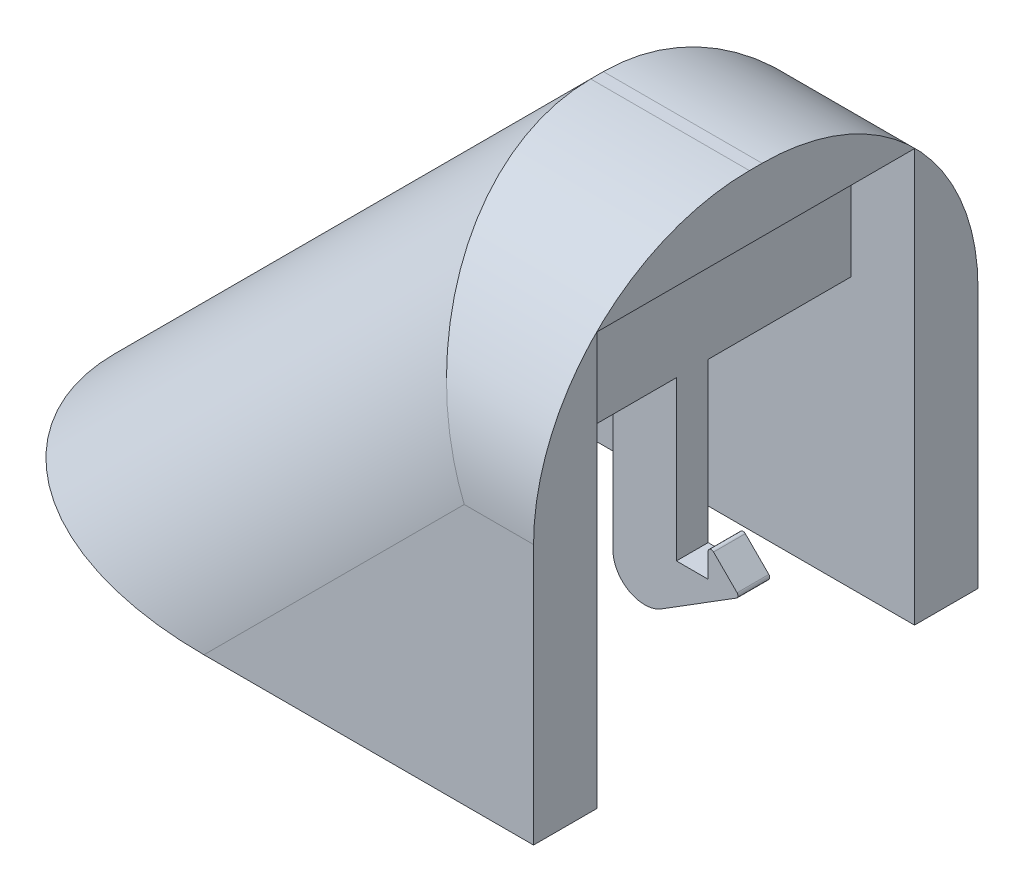
ISO-10303-21;
HEADER;
FILE_DESCRIPTION(('STEP AP214'),'2;1');
FILE_NAME('part.step','',(''),(''),'','','');
FILE_SCHEMA(('AUTOMOTIVE_DESIGN { 1 0 10303 214 1 1 1 1 }'));
ENDSEC;
DATA;
#1=APPLICATION_CONTEXT('core data for automotive mechanical design processes');
#2=APPLICATION_PROTOCOL_DEFINITION('international standard','automotive_design',2000,#1);
#3=PRODUCT_CONTEXT('',#1,'mechanical');
#4=PRODUCT('Part','Part','',(#3));
#5=PRODUCT_RELATED_PRODUCT_CATEGORY('part','',(#4));
#6=PRODUCT_DEFINITION_FORMATION('','',#4);
#7=PRODUCT_DEFINITION_CONTEXT('part definition',#1,'design');
#8=PRODUCT_DEFINITION('design','',#6,#7);
#9=PRODUCT_DEFINITION_SHAPE('','',#8);
#10=(LENGTH_UNIT() NAMED_UNIT(*) SI_UNIT(.MILLI.,.METRE.));
#11=(NAMED_UNIT(*) PLANE_ANGLE_UNIT() SI_UNIT($,.RADIAN.));
#12=(NAMED_UNIT(*) SI_UNIT($,.STERADIAN.) SOLID_ANGLE_UNIT());
#13=UNCERTAINTY_MEASURE_WITH_UNIT(LENGTH_MEASURE(1.E-05),#10,'distance_accuracy_value','');
#14=(GEOMETRIC_REPRESENTATION_CONTEXT(3) GLOBAL_UNCERTAINTY_ASSIGNED_CONTEXT((#13)) GLOBAL_UNIT_ASSIGNED_CONTEXT((#10,
#11,#12)) REPRESENTATION_CONTEXT('',''));
#15=CARTESIAN_POINT('',(0.,0.,0.));
#16=DIRECTION('',(0.,0.,1.));
#17=DIRECTION('',(1.,0.,0.));
#18=AXIS2_PLACEMENT_3D('',#15,#16,#17);
#19=CARTESIAN_POINT('',(-2.,8.5014980509861,7.002));
#20=DIRECTION('',(0.,1.,0.));
#21=DIRECTION('',(0.,0.,1.));
#22=AXIS2_PLACEMENT_3D('',#19,#20,#21);
#23=PLANE('',#22);
#24=DIRECTION('',(-1.,0.,0.));
#25=VECTOR('',#24,1.);
#26=CARTESIAN_POINT('',(-2.,8.5014980509861,0.5));
#27=LINE('',#26,#25);
#28=CARTESIAN_POINT('',(-2.,8.5014980509861,0.5));
#29=VERTEX_POINT('',#28);
#30=CARTESIAN_POINT('',(-4.,8.5014980509861,0.5));
#31=VERTEX_POINT('',#30);
#32=EDGE_CURVE('E261',#29,#31,#27,.T.);
#33=ORIENTED_EDGE('',*,*,#32,.F.);
#34=DIRECTION('',(0.,0.,-1.));
#35=VECTOR('',#34,1.);
#36=CARTESIAN_POINT('',(-2.,8.5014980509861,7.002));
#37=LINE('',#36,#35);
#38=CARTESIAN_POINT('',(-2.,8.5014980509861,5.));
#39=VERTEX_POINT('',#38);
#40=EDGE_CURVE('E285',#39,#29,#37,.T.);
#41=ORIENTED_EDGE('',*,*,#40,.F.);
#42=DIRECTION('',(1.,0.,0.));
#43=VECTOR('',#42,1.);
#44=CARTESIAN_POINT('',(-2.,8.5014980509861,5.));
#45=LINE('',#44,#43);
#46=CARTESIAN_POINT('',(-4.,8.5014980509861,5.));
#47=VERTEX_POINT('',#46);
#48=EDGE_CURVE('E293',#47,#39,#45,.T.);
#49=ORIENTED_EDGE('',*,*,#48,.F.);
#50=DIRECTION('',(0.,0.,-1.));
#51=VECTOR('',#50,1.);
#52=CARTESIAN_POINT('',(-4.,8.5014980509861,7.002));
#53=LINE('',#52,#51);
#54=EDGE_CURVE('E289',#47,#31,#53,.T.);
#55=ORIENTED_EDGE('',*,*,#54,.T.);
#56=EDGE_LOOP('',(#33,#41,#49,#55));
#57=FACE_BOUND('',#56,.T.);
#58=ADVANCED_FACE('F38',(#57),#23,.F.);
#59=DIRECTION('',(1.,0.,0.));
#60=VECTOR('',#59,1.);
#61=CARTESIAN_POINT('',(-2.,8.5014980509861,-0.5));
#62=LINE('',#61,#60);
#63=CARTESIAN_POINT('',(-4.,8.5014980509861,-0.499999999999999));
#64=VERTEX_POINT('',#63);
#65=CARTESIAN_POINT('',(-2.,8.5014980509861,-0.499999999999999));
#66=VERTEX_POINT('',#65);
#67=EDGE_CURVE('E264',#64,#66,#62,.T.);
#68=ORIENTED_EDGE('',*,*,#67,.F.);
#69=CARTESIAN_POINT('',(-4.,8.5014980509861,-5.));
#70=VERTEX_POINT('',#69);
#71=EDGE_CURVE('E288',#64,#70,#53,.T.);
#72=ORIENTED_EDGE('',*,*,#71,.T.);
#73=DIRECTION('',(1.,0.,0.));
#74=VECTOR('',#73,1.);
#75=CARTESIAN_POINT('',(-2.,8.5014980509861,-5.));
#76=LINE('',#75,#74);
#77=CARTESIAN_POINT('',(-2.,8.5014980509861,-5.));
#78=VERTEX_POINT('',#77);
#79=EDGE_CURVE('E281',#70,#78,#76,.T.);
#80=ORIENTED_EDGE('',*,*,#79,.T.);
#81=EDGE_CURVE('E280',#66,#78,#37,.T.);
#82=ORIENTED_EDGE('',*,*,#81,.F.);
#83=EDGE_LOOP('',(#68,#72,#80,#82));
#84=FACE_BOUND('',#83,.T.);
#85=ADVANCED_FACE('F469',(#84),#23,.F.);
#86=CARTESIAN_POINT('',(0.,13.,7.));
#87=DIRECTION('',(0.,-1.,0.));
#88=DIRECTION('',(0.,0.,-1.));
#89=AXIS2_PLACEMENT_3D('',#86,#87,#88);
#90=PLANE('',#89);
#91=DIRECTION('',(-1.,0.,0.));
#92=VECTOR('',#91,1.);
#93=CARTESIAN_POINT('',(0.,13.,5.));
#94=LINE('',#93,#92);
#95=CARTESIAN_POINT('',(0.,13.,5.));
#96=VERTEX_POINT('',#95);
#97=CARTESIAN_POINT('',(-2.,13.,5.));
#98=VERTEX_POINT('',#97);
#99=EDGE_CURVE('E318',#96,#98,#94,.T.);
#100=ORIENTED_EDGE('',*,*,#99,.T.);
#101=DIRECTION('',(0.,0.,1.));
#102=VECTOR('',#101,1.);
#103=CARTESIAN_POINT('',(-2.,13.,7.002));
#104=LINE('',#103,#102);
#105=CARTESIAN_POINT('',(-2.,13.,-5.));
#106=VERTEX_POINT('',#105);
#107=EDGE_CURVE('E299',#106,#98,#104,.T.);
#108=ORIENTED_EDGE('',*,*,#107,.F.);
#109=DIRECTION('',(-1.,0.,0.));
#110=VECTOR('',#109,1.);
#111=CARTESIAN_POINT('',(0.,13.,-5.));
#112=LINE('',#111,#110);
#113=CARTESIAN_POINT('',(0.,13.,-5.));
#114=VERTEX_POINT('',#113);
#115=EDGE_CURVE('E315',#114,#106,#112,.T.);
#116=ORIENTED_EDGE('',*,*,#115,.F.);
#117=DIRECTION('',(0.,0.,-1.));
#118=VECTOR('',#117,1.);
#119=CARTESIAN_POINT('',(0.,13.,7.));
#120=LINE('',#119,#118);
#121=EDGE_CURVE('E321',#96,#114,#120,.T.);
#122=ORIENTED_EDGE('',*,*,#121,.F.);
#123=EDGE_LOOP('',(#100,#108,#116,#122));
#124=FACE_BOUND('',#123,.T.);
#125=ADVANCED_FACE('F503',(#124),#90,.T.);
#126=CARTESIAN_POINT('',(-4.,13.,-5.));
#127=VERTEX_POINT('',#126);
#128=CARTESIAN_POINT('',(-4.17157287525381,13.,-5.));
#129=VERTEX_POINT('',#128);
#130=EDGE_CURVE('E324',#127,#129,#112,.T.);
#131=ORIENTED_EDGE('',*,*,#130,.F.);
#132=DIRECTION('',(0.,0.,-1.));
#133=VECTOR('',#132,1.);
#134=CARTESIAN_POINT('',(-4.,13.,7.002));
#135=LINE('',#134,#133);
#136=CARTESIAN_POINT('',(-4.,13.,5.));
#137=VERTEX_POINT('',#136);
#138=EDGE_CURVE('E292',#137,#127,#135,.T.);
#139=ORIENTED_EDGE('',*,*,#138,.F.);
#140=CARTESIAN_POINT('',(-4.17157287525381,13.,5.));
#141=VERTEX_POINT('',#140);
#142=EDGE_CURVE('E327',#137,#141,#94,.T.);
#143=ORIENTED_EDGE('',*,*,#142,.T.);
#144=DIRECTION('',(0.,0.,-1.));
#145=VECTOR('',#144,1.);
#146=CARTESIAN_POINT('',(-4.17157287525381,13.,7.));
#147=LINE('',#146,#145);
#148=EDGE_CURVE('E309',#141,#129,#147,.T.);
#149=ORIENTED_EDGE('',*,*,#148,.T.);
#150=EDGE_LOOP('',(#131,#139,#143,#149));
#151=FACE_BOUND('',#150,.T.);
#152=ADVANCED_FACE('F456',(#151),#90,.T.);
#153=CARTESIAN_POINT('',(0.,0.,5.));
#154=DIRECTION('',(0.,0.,1.));
#155=DIRECTION('',(1.,0.,0.));
#156=AXIS2_PLACEMENT_3D('',#153,#154,#155);
#157=PLANE('',#156);
#158=DIRECTION('',(0.,1.,0.));
#159=VECTOR('',#158,1.);
#160=CARTESIAN_POINT('',(-2.,18.5014980509861,5.));
#161=LINE('',#160,#159);
#162=EDGE_CURVE('E301',#39,#98,#161,.T.);
#163=ORIENTED_EDGE('',*,*,#162,.T.);
#164=ORIENTED_EDGE('',*,*,#99,.F.);
#165=DIRECTION('',(0.,1.,0.));
#166=VECTOR('',#165,1.);
#167=CARTESIAN_POINT('',(0.,0.,5.));
#168=LINE('',#167,#166);
#169=CARTESIAN_POINT('',(0.,0.,5.));
#170=VERTEX_POINT('',#169);
#171=EDGE_CURVE('E314',#170,#96,#168,.T.);
#172=ORIENTED_EDGE('',*,*,#171,.F.);
#173=DIRECTION('',(1.,0.,0.));
#174=VECTOR('',#173,1.);
#175=CARTESIAN_POINT('',(-20.,0.,5.));
#176=LINE('',#175,#174);
#177=CARTESIAN_POINT('',(-15.1715728752538,0.,5.));
#178=VERTEX_POINT('',#177);
#179=EDGE_CURVE('E258',#178,#170,#176,.T.);
#180=ORIENTED_EDGE('',*,*,#179,.F.);
#181=DIRECTION('',(0.,1.,0.));
#182=VECTOR('',#181,1.);
#183=CARTESIAN_POINT('',(-15.1715728752538,-3.,5.));
#184=LINE('',#183,#182);
#185=CARTESIAN_POINT('',(-15.1715728752538,2.,5.));
#186=VERTEX_POINT('',#185);
#187=EDGE_CURVE('E249',#178,#186,#184,.T.);
#188=ORIENTED_EDGE('',*,*,#187,.T.);
#189=DIRECTION('',(-0.707106781186548,-0.707106781186548,0.));
#190=VECTOR('',#189,1.);
#191=CARTESIAN_POINT('',(-3.58578643762691,13.5857864376269,5.));
#192=LINE('',#191,#190);
#193=EDGE_CURVE('E310',#141,#186,#192,.T.);
#194=ORIENTED_EDGE('',*,*,#193,.F.);
#195=ORIENTED_EDGE('',*,*,#142,.F.);
#196=DIRECTION('',(0.,-1.,0.));
#197=VECTOR('',#196,1.);
#198=CARTESIAN_POINT('',(-4.,18.5014980509861,5.));
#199=LINE('',#198,#197);
#200=EDGE_CURVE('E297',#137,#47,#199,.T.);
#201=ORIENTED_EDGE('',*,*,#200,.T.);
#202=ORIENTED_EDGE('',*,*,#48,.T.);
#203=EDGE_LOOP('',(#163,#164,#172,#180,#188,#194,#195,#201,#202));
#204=FACE_BOUND('',#203,.T.);
#205=ADVANCED_FACE('F441',(#204),#157,.F.);
#206=CARTESIAN_POINT('',(0.,0.,-5.));
#207=DIRECTION('',(0.,0.,1.));
#208=DIRECTION('',(1.,0.,0.));
#209=AXIS2_PLACEMENT_3D('',#206,#207,#208);
#210=PLANE('',#209);
#211=ORIENTED_EDGE('',*,*,#115,.T.);
#212=DIRECTION('',(0.,1.,0.));
#213=VECTOR('',#212,1.);
#214=CARTESIAN_POINT('',(-2.,18.5014980509861,-5.));
#215=LINE('',#214,#213);
#216=EDGE_CURVE('E276',#78,#106,#215,.T.);
#217=ORIENTED_EDGE('',*,*,#216,.F.);
#218=ORIENTED_EDGE('',*,*,#79,.F.);
#219=DIRECTION('',(0.,-1.,0.));
#220=VECTOR('',#219,1.);
#221=CARTESIAN_POINT('',(-4.,18.5014980509861,-5.));
#222=LINE('',#221,#220);
#223=EDGE_CURVE('E277',#127,#70,#222,.T.);
#224=ORIENTED_EDGE('',*,*,#223,.F.);
#225=ORIENTED_EDGE('',*,*,#130,.T.);
#226=DIRECTION('',(-0.707106781186548,-0.707106781186548,0.));
#227=VECTOR('',#226,1.);
#228=CARTESIAN_POINT('',(-3.58578643762691,13.5857864376269,-5.));
#229=LINE('',#228,#227);
#230=CARTESIAN_POINT('',(-15.1715728752538,2.,-5.));
#231=VERTEX_POINT('',#230);
#232=EDGE_CURVE('E311',#129,#231,#229,.T.);
#233=ORIENTED_EDGE('',*,*,#232,.T.);
#234=DIRECTION('',(0.,1.,0.));
#235=VECTOR('',#234,1.);
#236=CARTESIAN_POINT('',(-15.1715728752538,-3.,-5.));
#237=LINE('',#236,#235);
#238=CARTESIAN_POINT('',(-15.1715728752538,0.,-5.));
#239=VERTEX_POINT('',#238);
#240=EDGE_CURVE('E243',#239,#231,#237,.T.);
#241=ORIENTED_EDGE('',*,*,#240,.F.);
#242=DIRECTION('',(-1.,0.,0.));
#243=VECTOR('',#242,1.);
#244=CARTESIAN_POINT('',(-20.,0.,-5.));
#245=LINE('',#244,#243);
#246=CARTESIAN_POINT('',(0.,0.,-5.));
#247=VERTEX_POINT('',#246);
#248=EDGE_CURVE('E255',#247,#239,#245,.T.);
#249=ORIENTED_EDGE('',*,*,#248,.F.);
#250=DIRECTION('',(0.,1.,0.));
#251=VECTOR('',#250,1.);
#252=CARTESIAN_POINT('',(0.,0.,-5.));
#253=LINE('',#252,#251);
#254=EDGE_CURVE('E296',#247,#114,#253,.T.);
#255=ORIENTED_EDGE('',*,*,#254,.T.);
#256=EDGE_LOOP('',(#211,#217,#218,#224,#225,#233,#241,#249,#255));
#257=FACE_BOUND('',#256,.T.);
#258=ADVANCED_FACE('F465',(#257),#210,.T.);
#259=CARTESIAN_POINT('',(0.,0.,7.));
#260=DIRECTION('',(-1.,0.,0.));
#261=DIRECTION('',(0.,0.,1.));
#262=AXIS2_PLACEMENT_3D('',#259,#260,#261);
#263=PLANE('',#262);
#264=DIRECTION('',(0.,1.,0.));
#265=VECTOR('',#264,1.);
#266=CARTESIAN_POINT('',(0.,0.,-7.));
#267=LINE('',#266,#265);
#268=CARTESIAN_POINT('',(0.,0.,-7.));
#269=VERTEX_POINT('',#268);
#270=CARTESIAN_POINT('',(0.,8.2,-7.));
#271=VERTEX_POINT('',#270);
#272=EDGE_CURVE('E337',#269,#271,#267,.T.);
#273=ORIENTED_EDGE('',*,*,#272,.T.);
#274=CARTESIAN_POINT('',(0.,8.2,-0.199999999999999));
#275=DIRECTION('',(-1.,0.,0.));
#276=DIRECTION('',(0.,0.,1.));
#277=AXIS2_PLACEMENT_3D('',#274,#275,#276);
#278=CIRCLE('',#277,6.8);
#279=CARTESIAN_POINT('',(0.,15.,-0.199999999999997));
#280=VERTEX_POINT('',#279);
#281=EDGE_CURVE('E400',#271,#280,#278,.F.);
#282=ORIENTED_EDGE('',*,*,#281,.T.);
#283=DIRECTION('',(0.,0.,-1.));
#284=VECTOR('',#283,1.);
#285=CARTESIAN_POINT('',(0.,15.,7.));
#286=LINE('',#285,#284);
#287=CARTESIAN_POINT('',(0.,15.,0.200000000000001));
#288=VERTEX_POINT('',#287);
#289=EDGE_CURVE('E348',#288,#280,#286,.T.);
#290=ORIENTED_EDGE('',*,*,#289,.F.);
#291=CARTESIAN_POINT('',(0.,8.2,0.199999999999999));
#292=DIRECTION('',(-1.,0.,0.));
#293=DIRECTION('',(0.,0.,1.));
#294=AXIS2_PLACEMENT_3D('',#291,#292,#293);
#295=CIRCLE('',#294,6.8);
#296=CARTESIAN_POINT('',(0.,8.2,7.));
#297=VERTEX_POINT('',#296);
#298=EDGE_CURVE('E61',#288,#297,#295,.F.);
#299=ORIENTED_EDGE('',*,*,#298,.T.);
#300=DIRECTION('',(0.,1.,0.));
#301=VECTOR('',#300,1.);
#302=CARTESIAN_POINT('',(0.,0.,7.));
#303=LINE('',#302,#301);
#304=CARTESIAN_POINT('',(0.,0.,7.));
#305=VERTEX_POINT('',#304);
#306=EDGE_CURVE('E336',#305,#297,#303,.T.);
#307=ORIENTED_EDGE('',*,*,#306,.F.);
#308=DIRECTION('',(0.,0.,-1.));
#309=VECTOR('',#308,1.);
#310=CARTESIAN_POINT('',(0.,0.,7.));
#311=LINE('',#310,#309);
#312=EDGE_CURVE('E352',#305,#170,#311,.T.);
#313=ORIENTED_EDGE('',*,*,#312,.T.);
#314=ORIENTED_EDGE('',*,*,#171,.T.);
#315=ORIENTED_EDGE('',*,*,#121,.T.);
#316=ORIENTED_EDGE('',*,*,#254,.F.);
#317=EDGE_CURVE('E351',#247,#269,#311,.T.);
#318=ORIENTED_EDGE('',*,*,#317,.T.);
#319=EDGE_LOOP('',(#273,#282,#290,#299,#307,#313,#314,#315,#316,#318));
#320=FACE_BOUND('',#319,.T.);
#321=ADVANCED_FACE('F423',(#320),#263,.F.);
#322=CARTESIAN_POINT('',(-20.,0.,7.));
#323=DIRECTION('',(0.,1.,0.));
#324=DIRECTION('',(0.,0.,1.));
#325=AXIS2_PLACEMENT_3D('',#322,#323,#324);
#326=PLANE('',#325);
#327=DIRECTION('',(0.,0.,-1.));
#328=VECTOR('',#327,1.);
#329=CARTESIAN_POINT('',(-20.,0.,7.));
#330=LINE('',#329,#328);
#331=CARTESIAN_POINT('',(-20.,0.,0.200000000000001));
#332=VERTEX_POINT('',#331);
#333=CARTESIAN_POINT('',(-20.,0.,-0.199999999999997));
#334=VERTEX_POINT('',#333);
#335=EDGE_CURVE('E339',#332,#334,#330,.T.);
#336=ORIENTED_EDGE('',*,*,#335,.T.);
#337=CARTESIAN_POINT('',(-10.383347775863,0.,-0.199999999999999));
#338=DIRECTION('',(0.,1.,0.));
#339=DIRECTION('',(-1.,0.,0.));
#340=AXIS2_PLACEMENT_3D('',#337,#338,#339);
#341=ELLIPSE('',#340,9.61665222413705,6.8);
#342=CARTESIAN_POINT('',(-10.383347775863,0.,-7.));
#343=VERTEX_POINT('',#342);
#344=EDGE_CURVE('E389',#334,#343,#341,.F.);
#345=ORIENTED_EDGE('',*,*,#344,.T.);
#346=DIRECTION('',(1.,0.,0.));
#347=VECTOR('',#346,1.);
#348=CARTESIAN_POINT('',(-20.,0.,-7.));
#349=LINE('',#348,#347);
#350=EDGE_CURVE('E331',#343,#269,#349,.T.);
#351=ORIENTED_EDGE('',*,*,#350,.T.);
#352=ORIENTED_EDGE('',*,*,#317,.F.);
#353=ORIENTED_EDGE('',*,*,#248,.T.);
#354=DIRECTION('',(0.,0.,1.));
#355=VECTOR('',#354,1.);
#356=CARTESIAN_POINT('',(-15.1715728752538,0.,7.));
#357=LINE('',#356,#355);
#358=EDGE_CURVE('E251',#239,#178,#357,.T.);
#359=ORIENTED_EDGE('',*,*,#358,.T.);
#360=ORIENTED_EDGE('',*,*,#179,.T.);
#361=ORIENTED_EDGE('',*,*,#312,.F.);
#362=DIRECTION('',(1.,0.,0.));
#363=VECTOR('',#362,1.);
#364=CARTESIAN_POINT('',(-20.,0.,7.));
#365=LINE('',#364,#363);
#366=CARTESIAN_POINT('',(-10.383347775863,0.,7.));
#367=VERTEX_POINT('',#366);
#368=EDGE_CURVE('E334',#367,#305,#365,.T.);
#369=ORIENTED_EDGE('',*,*,#368,.F.);
#370=CARTESIAN_POINT('',(-10.383347775863,0.,0.199999999999999));
#371=DIRECTION('',(0.,1.,0.));
#372=DIRECTION('',(1.,0.,0.));
#373=AXIS2_PLACEMENT_3D('',#370,#371,#372);
#374=ELLIPSE('',#373,9.61665222413705,6.8);
#375=EDGE_CURVE('E387',#367,#332,#374,.F.);
#376=ORIENTED_EDGE('',*,*,#375,.T.);
#377=EDGE_LOOP('',(#336,#345,#351,#352,#353,#359,#360,#361,#369,#376));
#378=FACE_BOUND('',#377,.T.);
#379=ADVANCED_FACE('F434',(#378),#326,.F.);
#380=CARTESIAN_POINT('',(0.,15.,7.));
#381=DIRECTION('',(0.,-1.,0.));
#382=DIRECTION('',(0.,0.,-1.));
#383=AXIS2_PLACEMENT_3D('',#380,#381,#382);
#384=PLANE('',#383);
#385=ORIENTED_EDGE('',*,*,#289,.T.);
#386=DIRECTION('',(-1.,0.,0.));
#387=VECTOR('',#386,1.);
#388=CARTESIAN_POINT('',(0.,15.,-0.199999999999999));
#389=LINE('',#388,#387);
#390=CARTESIAN_POINT('',(-5.,15.,-0.199999999999997));
#391=VERTEX_POINT('',#390);
#392=EDGE_CURVE('E397',#280,#391,#389,.T.);
#393=ORIENTED_EDGE('',*,*,#392,.T.);
#394=DIRECTION('',(0.,0.,-1.));
#395=VECTOR('',#394,1.);
#396=CARTESIAN_POINT('',(-5.,15.,7.));
#397=LINE('',#396,#395);
#398=CARTESIAN_POINT('',(-5.,15.,0.200000000000001));
#399=VERTEX_POINT('',#398);
#400=EDGE_CURVE('E345',#399,#391,#397,.T.);
#401=ORIENTED_EDGE('',*,*,#400,.F.);
#402=DIRECTION('',(-1.,0.,0.));
#403=VECTOR('',#402,1.);
#404=CARTESIAN_POINT('',(0.,15.,0.199999999999999));
#405=LINE('',#404,#403);
#406=EDGE_CURVE('E395',#399,#288,#405,.F.);
#407=ORIENTED_EDGE('',*,*,#406,.T.);
#408=EDGE_LOOP('',(#385,#393,#401,#407));
#409=FACE_BOUND('',#408,.T.);
#410=ADVANCED_FACE('F421',(#409),#384,.F.);
#411=CARTESIAN_POINT('',(-5.,15.,7.));
#412=DIRECTION('',(0.707106781186548,-0.707106781186548,0.));
#413=DIRECTION('',(0.707106781186548,0.707106781186548,0.));
#414=AXIS2_PLACEMENT_3D('',#411,#412,#413);
#415=PLANE('',#414);
#416=ORIENTED_EDGE('',*,*,#400,.T.);
#417=DIRECTION('',(-0.707106781186548,-0.707106781186548,0.));
#418=VECTOR('',#417,1.);
#419=CARTESIAN_POINT('',(-5.,15.,-0.199999999999999));
#420=LINE('',#419,#418);
#421=EDGE_CURVE('E384',#391,#334,#420,.T.);
#422=ORIENTED_EDGE('',*,*,#421,.T.);
#423=ORIENTED_EDGE('',*,*,#335,.F.);
#424=DIRECTION('',(-0.707106781186548,-0.707106781186548,0.));
#425=VECTOR('',#424,1.);
#426=CARTESIAN_POINT('',(-5.,15.,0.199999999999999));
#427=LINE('',#426,#425);
#428=EDGE_CURVE('E382',#332,#399,#427,.F.);
#429=ORIENTED_EDGE('',*,*,#428,.T.);
#430=EDGE_LOOP('',(#416,#422,#423,#429));
#431=FACE_BOUND('',#430,.T.);
#432=ADVANCED_FACE('F431',(#431),#415,.F.);
#433=CARTESIAN_POINT('',(0.,0.,7.));
#434=DIRECTION('',(0.,0.,1.));
#435=DIRECTION('',(1.,0.,0.));
#436=AXIS2_PLACEMENT_3D('',#433,#434,#435);
#437=PLANE('',#436);
#438=DIRECTION('',(-1.,0.,0.));
#439=VECTOR('',#438,1.);
#440=CARTESIAN_POINT('',(-5.,8.2,7.));
#441=LINE('',#440,#439);
#442=CARTESIAN_POINT('',(-2.18334777586295,8.2,7.));
#443=VERTEX_POINT('',#442);
#444=EDGE_CURVE('E47',#297,#443,#441,.T.);
#445=ORIENTED_EDGE('',*,*,#444,.T.);
#446=DIRECTION('',(-0.707106781186548,-0.707106781186548,0.));
#447=VECTOR('',#446,1.);
#448=CARTESIAN_POINT('',(-15.1916738879315,-4.80832611206852,7.));
#449=LINE('',#448,#447);
#450=EDGE_CURVE('E11',#443,#367,#449,.T.);
#451=ORIENTED_EDGE('',*,*,#450,.T.);
#452=ORIENTED_EDGE('',*,*,#368,.T.);
#453=ORIENTED_EDGE('',*,*,#306,.T.);
#454=EDGE_LOOP('',(#445,#451,#452,#453));
#455=FACE_BOUND('',#454,.T.);
#456=ADVANCED_FACE('F438',(#455),#437,.T.);
#457=CARTESIAN_POINT('',(0.,0.,-7.));
#458=DIRECTION('',(0.,0.,1.));
#459=DIRECTION('',(1.,0.,0.));
#460=AXIS2_PLACEMENT_3D('',#457,#458,#459);
#461=PLANE('',#460);
#462=ORIENTED_EDGE('',*,*,#350,.F.);
#463=DIRECTION('',(-0.707106781186548,-0.707106781186548,0.));
#464=VECTOR('',#463,1.);
#465=CARTESIAN_POINT('',(-5.19167388793148,5.19167388793148,-7.));
#466=LINE('',#465,#464);
#467=CARTESIAN_POINT('',(-2.18334777586295,8.2,-7.));
#468=VERTEX_POINT('',#467);
#469=EDGE_CURVE('E393',#343,#468,#466,.F.);
#470=ORIENTED_EDGE('',*,*,#469,.T.);
#471=DIRECTION('',(-1.,0.,0.));
#472=VECTOR('',#471,1.);
#473=CARTESIAN_POINT('',(0.,8.2,-7.));
#474=LINE('',#473,#472);
#475=EDGE_CURVE('E391',#468,#271,#474,.F.);
#476=ORIENTED_EDGE('',*,*,#475,.T.);
#477=ORIENTED_EDGE('',*,*,#272,.F.);
#478=EDGE_LOOP('',(#462,#470,#476,#477));
#479=FACE_BOUND('',#478,.T.);
#480=ADVANCED_FACE('F508',(#479),#461,.F.);
#481=CARTESIAN_POINT('',(-3.58578643762691,13.5857864376269,7.));
#482=DIRECTION('',(0.707106781186548,-0.707106781186548,0.));
#483=DIRECTION('',(0.707106781186548,0.707106781186548,0.));
#484=AXIS2_PLACEMENT_3D('',#481,#482,#483);
#485=PLANE('',#484);
#486=ORIENTED_EDGE('',*,*,#232,.F.);
#487=ORIENTED_EDGE('',*,*,#148,.F.);
#488=ORIENTED_EDGE('',*,*,#193,.T.);
#489=DIRECTION('',(0.,0.,-1.));
#490=VECTOR('',#489,1.);
#491=CARTESIAN_POINT('',(-15.1715728752538,2.,7.));
#492=LINE('',#491,#490);
#493=EDGE_CURVE('E306',#186,#231,#492,.T.);
#494=ORIENTED_EDGE('',*,*,#493,.T.);
#495=EDGE_LOOP('',(#486,#487,#488,#494));
#496=FACE_BOUND('',#495,.T.);
#497=ADVANCED_FACE('F451',(#496),#485,.T.);
#498=CARTESIAN_POINT('',(-2.,18.5014980509861,7.002));
#499=DIRECTION('',(-1.,0.,0.));
#500=DIRECTION('',(0.,-1.,0.));
#501=AXIS2_PLACEMENT_3D('',#498,#499,#500);
#502=PLANE('',#501);
#503=ORIENTED_EDGE('',*,*,#162,.F.);
#504=ORIENTED_EDGE('',*,*,#40,.T.);
#505=DIRECTION('',(0.,1.,0.));
#506=VECTOR('',#505,1.);
#507=CARTESIAN_POINT('',(-2.,3.5014980509861,0.5));
#508=LINE('',#507,#506);
#509=CARTESIAN_POINT('',(-2.,3.5014980509861,0.500000000000001));
#510=VERTEX_POINT('',#509);
#511=EDGE_CURVE('E273',#510,#29,#508,.T.);
#512=ORIENTED_EDGE('',*,*,#511,.F.);
#513=DIRECTION('',(0.,0.,1.));
#514=VECTOR('',#513,1.);
#515=CARTESIAN_POINT('',(-2.,3.5014980509861,0.5));
#516=LINE('',#515,#514);
#517=CARTESIAN_POINT('',(-2.,3.5014980509861,-0.5));
#518=VERTEX_POINT('',#517);
#519=EDGE_CURVE('E262',#518,#510,#516,.T.);
#520=ORIENTED_EDGE('',*,*,#519,.F.);
#521=DIRECTION('',(0.,1.,0.));
#522=VECTOR('',#521,1.);
#523=CARTESIAN_POINT('',(-2.,3.5014980509861,-0.5));
#524=LINE('',#523,#522);
#525=EDGE_CURVE('E239',#518,#66,#524,.T.);
#526=ORIENTED_EDGE('',*,*,#525,.T.);
#527=ORIENTED_EDGE('',*,*,#81,.T.);
#528=ORIENTED_EDGE('',*,*,#216,.T.);
#529=ORIENTED_EDGE('',*,*,#107,.T.);
#530=EDGE_LOOP('',(#503,#504,#512,#520,#526,#527,#528,#529));
#531=FACE_BOUND('',#530,.T.);
#532=ADVANCED_FACE('F498',(#531),#502,.F.);
#533=CARTESIAN_POINT('',(-4.,18.5014980509861,7.002));
#534=DIRECTION('',(1.,0.,0.));
#535=DIRECTION('',(0.,1.,0.));
#536=AXIS2_PLACEMENT_3D('',#533,#534,#535);
#537=PLANE('',#536);
#538=DIRECTION('',(0.,1.,0.));
#539=VECTOR('',#538,1.);
#540=CARTESIAN_POINT('',(-4.,3.5014980509861,-0.499999999999999));
#541=LINE('',#540,#539);
#542=CARTESIAN_POINT('',(-4.,2.80574569249318,-0.499999999999999));
#543=VERTEX_POINT('',#542);
#544=EDGE_CURVE('E269',#543,#64,#541,.T.);
#545=ORIENTED_EDGE('',*,*,#544,.F.);
#546=DIRECTION('',(0.,0.,-1.));
#547=VECTOR('',#546,1.);
#548=CARTESIAN_POINT('',(-4.,2.80574569249318,7.002));
#549=LINE('',#548,#547);
#550=CARTESIAN_POINT('',(-4.,2.80574569249318,0.5));
#551=VERTEX_POINT('',#550);
#552=EDGE_CURVE('E378',#543,#551,#549,.F.);
#553=ORIENTED_EDGE('',*,*,#552,.T.);
#554=DIRECTION('',(0.,1.,0.));
#555=VECTOR('',#554,1.);
#556=CARTESIAN_POINT('',(-4.,3.5014980509861,0.5));
#557=LINE('',#556,#555);
#558=EDGE_CURVE('E271',#551,#31,#557,.T.);
#559=ORIENTED_EDGE('',*,*,#558,.T.);
#560=ORIENTED_EDGE('',*,*,#54,.F.);
#561=ORIENTED_EDGE('',*,*,#200,.F.);
#562=ORIENTED_EDGE('',*,*,#138,.T.);
#563=ORIENTED_EDGE('',*,*,#223,.T.);
#564=ORIENTED_EDGE('',*,*,#71,.F.);
#565=EDGE_LOOP('',(#545,#553,#559,#560,#561,#562,#563,#564));
#566=FACE_BOUND('',#565,.T.);
#567=ADVANCED_FACE('F460',(#566),#537,.F.);
#568=CARTESIAN_POINT('',(-2.,3.5014980509861,0.5));
#569=DIRECTION('',(0.,0.,-1.));
#570=DIRECTION('',(-1.,0.,0.));
#571=AXIS2_PLACEMENT_3D('',#568,#569,#570);
#572=PLANE('',#571);
#573=ORIENTED_EDGE('',*,*,#558,.F.);
#574=CARTESIAN_POINT('',(-3.,2.80574569249318,0.5));
#575=DIRECTION('',(0.,0.,-1.));
#576=DIRECTION('',(-1.,0.,0.));
#577=AXIS2_PLACEMENT_3D('',#574,#575,#576);
#578=CIRCLE('',#577,1.);
#579=CARTESIAN_POINT('',(-2.47000105999682,1.95774738848809,0.500000000000001));
#580=VERTEX_POINT('',#579);
#581=EDGE_CURVE('E380',#551,#580,#578,.F.);
#582=ORIENTED_EDGE('',*,*,#581,.T.);
#583=DIRECTION('',(-0.847998304005088,-0.52999894000318,0.));
#584=VECTOR('',#583,1.);
#585=CARTESIAN_POINT('',(0.,3.5014980509861,0.500000000000001));
#586=LINE('',#585,#584);
#587=CARTESIAN_POINT('',(-0.106597718546153,3.43487447689476,0.500000000000001));
#588=VERTEX_POINT('',#587);
#589=EDGE_CURVE('E241',#588,#580,#586,.T.);
#590=ORIENTED_EDGE('',*,*,#589,.F.);
#591=CARTESIAN_POINT('',(-0.15959761254647,3.51967430729526,0.5));
#592=DIRECTION('',(0.,0.,-1.));
#593=DIRECTION('',(-1.,0.,0.));
#594=AXIS2_PLACEMENT_3D('',#591,#592,#593);
#595=CIRCLE('',#594,0.1);
#596=CARTESIAN_POINT('',(-0.0888869344278153,3.59038498541392,0.500000000000001));
#597=VERTEX_POINT('',#596);
#598=EDGE_CURVE('E360',#588,#597,#595,.F.);
#599=ORIENTED_EDGE('',*,*,#598,.T.);
#600=DIRECTION('',(-0.707106781186548,0.707106781186547,0.));
#601=VECTOR('',#600,1.);
#602=CARTESIAN_POINT('',(-0.999999999999999,4.5014980509861,0.500000000000001));
#603=LINE('',#602,#601);
#604=CARTESIAN_POINT('',(-0.829289321881345,4.33078737286745,0.500000000000001));
#605=VERTEX_POINT('',#604);
#606=EDGE_CURVE('E404',#597,#605,#603,.T.);
#607=ORIENTED_EDGE('',*,*,#606,.T.);
#608=CARTESIAN_POINT('',(-0.899999999999999,4.26007669474879,0.500000000000001));
#609=DIRECTION('',(0.,0.,-1.));
#610=DIRECTION('',(-1.,0.,0.));
#611=AXIS2_PLACEMENT_3D('',#608,#609,#610);
#612=CIRCLE('',#611,0.1);
#613=CARTESIAN_POINT('',(-0.999999999999999,4.26007669474879,0.500000000000001));
#614=VERTEX_POINT('',#613);
#615=EDGE_CURVE('E362',#605,#614,#612,.F.);
#616=ORIENTED_EDGE('',*,*,#615,.T.);
#617=DIRECTION('',(0.,-1.,0.));
#618=VECTOR('',#617,1.);
#619=CARTESIAN_POINT('',(-0.999999999999999,3.5014980509861,0.500000000000001));
#620=LINE('',#619,#618);
#621=CARTESIAN_POINT('',(-0.999999999999999,3.5014980509861,0.500000000000001));
#622=VERTEX_POINT('',#621);
#623=EDGE_CURVE('E410',#614,#622,#620,.T.);
#624=ORIENTED_EDGE('',*,*,#623,.T.);
#625=DIRECTION('',(-1.,0.,0.));
#626=VECTOR('',#625,1.);
#627=CARTESIAN_POINT('',(-4.,3.5014980509861,0.5));
#628=LINE('',#627,#626);
#629=EDGE_CURVE('E232',#622,#510,#628,.T.);
#630=ORIENTED_EDGE('',*,*,#629,.T.);
#631=ORIENTED_EDGE('',*,*,#511,.T.);
#632=ORIENTED_EDGE('',*,*,#32,.T.);
#633=EDGE_LOOP('',(#573,#582,#590,#599,#607,#616,#624,#630,#631,#632));
#634=FACE_BOUND('',#633,.T.);
#635=ADVANCED_FACE('F478',(#634),#572,.F.);
#636=CARTESIAN_POINT('',(-2.,3.5014980509861,-0.5));
#637=DIRECTION('',(0.,0.,1.));
#638=DIRECTION('',(1.,0.,0.));
#639=AXIS2_PLACEMENT_3D('',#636,#637,#638);
#640=PLANE('',#639);
#641=DIRECTION('',(0.847998304005088,0.52999894000318,0.));
#642=VECTOR('',#641,1.);
#643=CARTESIAN_POINT('',(0.,3.5014980509861,-0.5));
#644=LINE('',#643,#642);
#645=CARTESIAN_POINT('',(-2.47000105999682,1.95774738848809,-0.499999999999999));
#646=VERTEX_POINT('',#645);
#647=CARTESIAN_POINT('',(-0.106597718546153,3.43487447689476,-0.5));
#648=VERTEX_POINT('',#647);
#649=EDGE_CURVE('E233',#646,#648,#644,.T.);
#650=ORIENTED_EDGE('',*,*,#649,.F.);
#651=CARTESIAN_POINT('',(-3.,2.80574569249318,-0.5));
#652=DIRECTION('',(0.,0.,1.));
#653=DIRECTION('',(1.,0.,0.));
#654=AXIS2_PLACEMENT_3D('',#651,#652,#653);
#655=CIRCLE('',#654,1.);
#656=EDGE_CURVE('E376',#646,#543,#655,.F.);
#657=ORIENTED_EDGE('',*,*,#656,.T.);
#658=ORIENTED_EDGE('',*,*,#544,.T.);
#659=ORIENTED_EDGE('',*,*,#67,.T.);
#660=ORIENTED_EDGE('',*,*,#525,.F.);
#661=DIRECTION('',(1.,0.,0.));
#662=VECTOR('',#661,1.);
#663=CARTESIAN_POINT('',(-4.,3.5014980509861,-0.5));
#664=LINE('',#663,#662);
#665=CARTESIAN_POINT('',(-0.999999999999999,3.5014980509861,-0.5));
#666=VERTEX_POINT('',#665);
#667=EDGE_CURVE('E231',#518,#666,#664,.T.);
#668=ORIENTED_EDGE('',*,*,#667,.T.);
#669=DIRECTION('',(0.,-1.,0.));
#670=VECTOR('',#669,1.);
#671=CARTESIAN_POINT('',(-0.999999999999999,3.5014980509861,-0.5));
#672=LINE('',#671,#670);
#673=CARTESIAN_POINT('',(-0.999999999999999,4.26007669474879,-0.5));
#674=VERTEX_POINT('',#673);
#675=EDGE_CURVE('E214',#674,#666,#672,.T.);
#676=ORIENTED_EDGE('',*,*,#675,.F.);
#677=CARTESIAN_POINT('',(-0.899999999999999,4.26007669474879,-0.5));
#678=DIRECTION('',(0.,0.,1.));
#679=DIRECTION('',(1.,0.,0.));
#680=AXIS2_PLACEMENT_3D('',#677,#678,#679);
#681=CIRCLE('',#680,0.1);
#682=CARTESIAN_POINT('',(-0.829289321881345,4.33078737286745,-0.5));
#683=VERTEX_POINT('',#682);
#684=EDGE_CURVE('E368',#674,#683,#681,.F.);
#685=ORIENTED_EDGE('',*,*,#684,.T.);
#686=DIRECTION('',(-0.707106781186548,0.707106781186547,0.));
#687=VECTOR('',#686,1.);
#688=CARTESIAN_POINT('',(-0.999999999999999,4.5014980509861,-0.5));
#689=LINE('',#688,#687);
#690=CARTESIAN_POINT('',(-0.0888869344278153,3.59038498541392,-0.5));
#691=VERTEX_POINT('',#690);
#692=EDGE_CURVE('E225',#691,#683,#689,.T.);
#693=ORIENTED_EDGE('',*,*,#692,.F.);
#694=CARTESIAN_POINT('',(-0.15959761254647,3.51967430729526,-0.5));
#695=DIRECTION('',(0.,0.,1.));
#696=DIRECTION('',(1.,0.,0.));
#697=AXIS2_PLACEMENT_3D('',#694,#695,#696);
#698=CIRCLE('',#697,0.1);
#699=EDGE_CURVE('E365',#691,#648,#698,.F.);
#700=ORIENTED_EDGE('',*,*,#699,.T.);
#701=EDGE_LOOP('',(#650,#657,#658,#659,#660,#668,#676,#685,#693,#700));
#702=FACE_BOUND('',#701,.T.);
#703=ADVANCED_FACE('F236',(#702),#640,.F.);
#704=CARTESIAN_POINT('',(-15.1715728752538,-3.,-5.));
#705=DIRECTION('',(-1.,0.,0.));
#706=DIRECTION('',(0.,0.,1.));
#707=AXIS2_PLACEMENT_3D('',#704,#705,#706);
#708=PLANE('',#707);
#709=ORIENTED_EDGE('',*,*,#240,.T.);
#710=ORIENTED_EDGE('',*,*,#493,.F.);
#711=ORIENTED_EDGE('',*,*,#187,.F.);
#712=ORIENTED_EDGE('',*,*,#358,.F.);
#713=EDGE_LOOP('',(#709,#710,#711,#712));
#714=FACE_BOUND('',#713,.T.);
#715=ADVANCED_FACE('F446',(#714),#708,.F.);
#716=CARTESIAN_POINT('',(0.,3.5014980509861,0.));
#717=DIRECTION('',(0.,-1.,0.));
#718=DIRECTION('',(0.,0.,-1.));
#719=AXIS2_PLACEMENT_3D('',#716,#717,#718);
#720=PLANE('',#719);
#721=ORIENTED_EDGE('',*,*,#629,.F.);
#722=DIRECTION('',(0.,0.,1.));
#723=VECTOR('',#722,1.);
#724=CARTESIAN_POINT('',(-0.999999999999999,3.5014980509861,-0.5));
#725=LINE('',#724,#723);
#726=EDGE_CURVE('E218',#666,#622,#725,.T.);
#727=ORIENTED_EDGE('',*,*,#726,.F.);
#728=ORIENTED_EDGE('',*,*,#667,.F.);
#729=ORIENTED_EDGE('',*,*,#519,.T.);
#730=EDGE_LOOP('',(#721,#727,#728,#729));
#731=FACE_BOUND('',#730,.T.);
#732=ADVANCED_FACE('F229',(#731),#720,.F.);
#733=CARTESIAN_POINT('',(0.,3.5014980509861,-7.001));
#734=DIRECTION('',(-0.52999894000318,0.847998304005088,0.));
#735=DIRECTION('',(-0.847998304005088,-0.52999894000318,0.));
#736=AXIS2_PLACEMENT_3D('',#733,#734,#735);
#737=PLANE('',#736);
#738=ORIENTED_EDGE('',*,*,#589,.T.);
#739=DIRECTION('',(0.,0.,-1.));
#740=VECTOR('',#739,1.);
#741=CARTESIAN_POINT('',(-2.47000105999682,1.95774738848809,-7.001));
#742=LINE('',#741,#740);
#743=EDGE_CURVE('E373',#580,#646,#742,.T.);
#744=ORIENTED_EDGE('',*,*,#743,.T.);
#745=ORIENTED_EDGE('',*,*,#649,.T.);
#746=DIRECTION('',(0.,0.,1.));
#747=VECTOR('',#746,1.);
#748=CARTESIAN_POINT('',(-0.106597718546153,3.43487447689476,0.5));
#749=LINE('',#748,#747);
#750=EDGE_CURVE('E370',#648,#588,#749,.T.);
#751=ORIENTED_EDGE('',*,*,#750,.T.);
#752=EDGE_LOOP('',(#738,#744,#745,#751));
#753=FACE_BOUND('',#752,.T.);
#754=ADVANCED_FACE('F480',(#753),#737,.F.);
#755=CARTESIAN_POINT('',(-0.999999999999999,4.5014980509861,-0.5));
#756=DIRECTION('',(0.707106781186547,0.707106781186548,0.));
#757=DIRECTION('',(-0.707106781186548,0.707106781186547,0.));
#758=AXIS2_PLACEMENT_3D('',#755,#756,#757);
#759=PLANE('',#758);
#760=ORIENTED_EDGE('',*,*,#692,.T.);
#761=DIRECTION('',(0.,0.,1.));
#762=VECTOR('',#761,1.);
#763=CARTESIAN_POINT('',(-0.829289321881345,4.33078737286745,-0.5));
#764=LINE('',#763,#762);
#765=EDGE_CURVE('E357',#683,#605,#764,.T.);
#766=ORIENTED_EDGE('',*,*,#765,.T.);
#767=ORIENTED_EDGE('',*,*,#606,.F.);
#768=DIRECTION('',(0.,0.,1.));
#769=VECTOR('',#768,1.);
#770=CARTESIAN_POINT('',(-0.0888869344278155,3.59038498541392,-0.5));
#771=LINE('',#770,#769);
#772=EDGE_CURVE('E355',#597,#691,#771,.F.);
#773=ORIENTED_EDGE('',*,*,#772,.T.);
#774=EDGE_LOOP('',(#760,#766,#767,#773));
#775=FACE_BOUND('',#774,.T.);
#776=ADVANCED_FACE('F489',(#775),#759,.T.);
#777=CARTESIAN_POINT('',(-0.999999999999999,3.5014980509861,-0.5));
#778=DIRECTION('',(-1.,0.,0.));
#779=DIRECTION('',(0.,0.,1.));
#780=AXIS2_PLACEMENT_3D('',#777,#778,#779);
#781=PLANE('',#780);
#782=ORIENTED_EDGE('',*,*,#623,.F.);
#783=DIRECTION('',(0.,0.,1.));
#784=VECTOR('',#783,1.);
#785=CARTESIAN_POINT('',(-0.999999999999999,4.26007669474879,-0.5));
#786=LINE('',#785,#784);
#787=EDGE_CURVE('E221',#614,#674,#786,.F.);
#788=ORIENTED_EDGE('',*,*,#787,.T.);
#789=ORIENTED_EDGE('',*,*,#675,.T.);
#790=ORIENTED_EDGE('',*,*,#726,.T.);
#791=EDGE_LOOP('',(#782,#788,#789,#790));
#792=FACE_BOUND('',#791,.T.);
#793=ADVANCED_FACE('F217',(#792),#781,.T.);
#794=CARTESIAN_POINT('',(-0.899999999999999,4.26007669474879,-0.5));
#795=DIRECTION('',(0.,0.,1.));
#796=DIRECTION('',(1.,0.,0.));
#797=AXIS2_PLACEMENT_3D('',#794,#795,#796);
#798=CYLINDRICAL_SURFACE('',#797,0.1);
#799=ORIENTED_EDGE('',*,*,#684,.F.);
#800=ORIENTED_EDGE('',*,*,#787,.F.);
#801=ORIENTED_EDGE('',*,*,#615,.F.);
#802=ORIENTED_EDGE('',*,*,#765,.F.);
#803=EDGE_LOOP('',(#799,#800,#801,#802));
#804=FACE_BOUND('',#803,.T.);
#805=ADVANCED_FACE('F493',(#804),#798,.T.);
#806=CARTESIAN_POINT('',(-0.15959761254647,3.51967430729526,-7.001));
#807=DIRECTION('',(0.,0.,-1.));
#808=DIRECTION('',(-1.,0.,0.));
#809=AXIS2_PLACEMENT_3D('',#806,#807,#808);
#810=CYLINDRICAL_SURFACE('',#809,0.1);
#811=ORIENTED_EDGE('',*,*,#699,.F.);
#812=ORIENTED_EDGE('',*,*,#772,.F.);
#813=ORIENTED_EDGE('',*,*,#598,.F.);
#814=ORIENTED_EDGE('',*,*,#750,.F.);
#815=EDGE_LOOP('',(#811,#812,#813,#814));
#816=FACE_BOUND('',#815,.T.);
#817=ADVANCED_FACE('F484',(#816),#810,.T.);
#818=CARTESIAN_POINT('',(-3.,2.80574569249318,-7.001));
#819=DIRECTION('',(0.,0.,-1.));
#820=DIRECTION('',(-1.,0.,0.));
#821=AXIS2_PLACEMENT_3D('',#818,#819,#820);
#822=CYLINDRICAL_SURFACE('',#821,1.);
#823=ORIENTED_EDGE('',*,*,#581,.F.);
#824=ORIENTED_EDGE('',*,*,#552,.F.);
#825=ORIENTED_EDGE('',*,*,#656,.F.);
#826=ORIENTED_EDGE('',*,*,#743,.F.);
#827=EDGE_LOOP('',(#823,#824,#825,#826));
#828=FACE_BOUND('',#827,.T.);
#829=ADVANCED_FACE('F474',(#828),#822,.T.);
#830=CARTESIAN_POINT('',(0.,8.2,-0.199999999999999));
#831=DIRECTION('',(-1.,0.,0.));
#832=DIRECTION('',(0.,0.,1.));
#833=AXIS2_PLACEMENT_3D('',#830,#831,#832);
#834=CYLINDRICAL_SURFACE('',#833,6.8);
#835=ORIENTED_EDGE('',*,*,#281,.F.);
#836=ORIENTED_EDGE('',*,*,#475,.F.);
#837=CARTESIAN_POINT('',(-2.18334777586295,8.2,-0.199999999999999));
#838=DIRECTION('',(-0.923879532511287,-0.38268343236509,0.));
#839=DIRECTION('',(-0.38268343236509,0.923879532511287,0.));
#840=AXIS2_PLACEMENT_3D('',#837,#838,#839);
#841=ELLIPSE('',#840,7.36026696198828,6.8);
#842=EDGE_CURVE('E402',#391,#468,#841,.T.);
#843=ORIENTED_EDGE('',*,*,#842,.F.);
#844=ORIENTED_EDGE('',*,*,#392,.F.);
#845=EDGE_LOOP('',(#835,#836,#843,#844));
#846=FACE_BOUND('',#845,.T.);
#847=ADVANCED_FACE('F429',(#846),#834,.T.);
#848=CARTESIAN_POINT('',(-0.191673887931476,10.1916738879315,-0.199999999999999));
#849=DIRECTION('',(-0.707106781186548,-0.707106781186548,0.));
#850=DIRECTION('',(0.707106781186548,-0.707106781186548,0.));
#851=AXIS2_PLACEMENT_3D('',#848,#849,#850);
#852=CYLINDRICAL_SURFACE('',#851,6.8);
#853=ORIENTED_EDGE('',*,*,#842,.T.);
#854=ORIENTED_EDGE('',*,*,#469,.F.);
#855=ORIENTED_EDGE('',*,*,#344,.F.);
#856=ORIENTED_EDGE('',*,*,#421,.F.);
#857=EDGE_LOOP('',(#853,#854,#855,#856));
#858=FACE_BOUND('',#857,.T.);
#859=ADVANCED_FACE('F509',(#858),#852,.T.);
#860=CARTESIAN_POINT('',(0.,8.2,0.199999999999999));
#861=DIRECTION('',(1.,0.,0.));
#862=DIRECTION('',(0.,0.,-1.));
#863=AXIS2_PLACEMENT_3D('',#860,#861,#862);
#864=CYLINDRICAL_SURFACE('',#863,6.8);
#865=ORIENTED_EDGE('',*,*,#298,.F.);
#866=ORIENTED_EDGE('',*,*,#406,.F.);
#867=CARTESIAN_POINT('',(-2.18334777586295,8.2,0.199999999999999));
#868=DIRECTION('',(0.923879532511287,0.38268343236509,0.));
#869=DIRECTION('',(0.38268343236509,-0.923879532511287,0.));
#870=AXIS2_PLACEMENT_3D('',#867,#868,#869);
#871=ELLIPSE('',#870,7.36026696198828,6.8);
#872=EDGE_CURVE('E42',#443,#399,#871,.F.);
#873=ORIENTED_EDGE('',*,*,#872,.F.);
#874=ORIENTED_EDGE('',*,*,#444,.F.);
#875=EDGE_LOOP('',(#865,#866,#873,#874));
#876=FACE_BOUND('',#875,.T.);
#877=ADVANCED_FACE('F40',(#876),#864,.T.);
#878=CARTESIAN_POINT('',(-5.19167388793148,5.19167388793148,0.199999999999999));
#879=DIRECTION('',(0.707106781186548,0.707106781186548,0.));
#880=DIRECTION('',(-0.707106781186548,0.707106781186548,0.));
#881=AXIS2_PLACEMENT_3D('',#878,#879,#880);
#882=CYLINDRICAL_SURFACE('',#881,6.8);
#883=ORIENTED_EDGE('',*,*,#872,.T.);
#884=ORIENTED_EDGE('',*,*,#428,.F.);
#885=ORIENTED_EDGE('',*,*,#375,.F.);
#886=ORIENTED_EDGE('',*,*,#450,.F.);
#887=EDGE_LOOP('',(#883,#884,#885,#886));
#888=FACE_BOUND('',#887,.T.);
#889=ADVANCED_FACE('F416',(#888),#882,.T.);
#890=CLOSED_SHELL('',(#58,#85,#125,#152,#205,#258,#321,#379,#410,#432,#456,#480,#497,#532,#567,
#635,#703,#715,#732,#754,#776,#793,#805,#817,#829,#847,#859,#877,#889));
#891=MANIFOLD_SOLID_BREP('B2',#890);
#892=ADVANCED_BREP_SHAPE_REPRESENTATION('',(#18,#891),#14);
#893=SHAPE_DEFINITION_REPRESENTATION(#9,#892);
ENDSEC;
END-ISO-10303-21;
